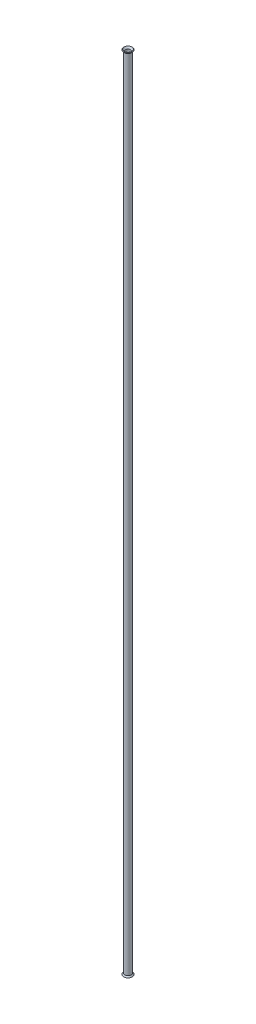
ISO-10303-21;
HEADER;
FILE_DESCRIPTION(('STEP AP214'),'2;1');
FILE_NAME('part.step','',(''),(''),'','','');
FILE_SCHEMA(('AUTOMOTIVE_DESIGN { 1 0 10303 214 1 1 1 1 }'));
ENDSEC;
DATA;
#1=APPLICATION_CONTEXT('core data for automotive mechanical design processes');
#2=APPLICATION_PROTOCOL_DEFINITION('international standard','automotive_design',2000,#1);
#3=PRODUCT_CONTEXT('',#1,'mechanical');
#4=PRODUCT('Part','Part','',(#3));
#5=PRODUCT_RELATED_PRODUCT_CATEGORY('part','',(#4));
#6=PRODUCT_DEFINITION_FORMATION('','',#4);
#7=PRODUCT_DEFINITION_CONTEXT('part definition',#1,'design');
#8=PRODUCT_DEFINITION('design','',#6,#7);
#9=PRODUCT_DEFINITION_SHAPE('','',#8);
#10=(LENGTH_UNIT() NAMED_UNIT(*) SI_UNIT(.MILLI.,.METRE.));
#11=(NAMED_UNIT(*) PLANE_ANGLE_UNIT() SI_UNIT($,.RADIAN.));
#12=(NAMED_UNIT(*) SI_UNIT($,.STERADIAN.) SOLID_ANGLE_UNIT());
#13=UNCERTAINTY_MEASURE_WITH_UNIT(LENGTH_MEASURE(1.E-05),#10,'distance_accuracy_value','');
#14=(GEOMETRIC_REPRESENTATION_CONTEXT(3) GLOBAL_UNCERTAINTY_ASSIGNED_CONTEXT((#13)) GLOBAL_UNIT_ASSIGNED_CONTEXT((#10,
#11,#12)) REPRESENTATION_CONTEXT('',''));
#15=CARTESIAN_POINT('',(0.,0.,0.));
#16=DIRECTION('',(0.,0.,1.));
#17=DIRECTION('',(1.,0.,0.));
#18=AXIS2_PLACEMENT_3D('',#15,#16,#17);
#19=CARTESIAN_POINT('',(0.,3093.72,0.));
#20=DIRECTION('',(0.,-1.,0.));
#21=DIRECTION('',(0.,0.,-1.));
#22=AXIS2_PLACEMENT_3D('',#19,#20,#21);
#23=CYLINDRICAL_SURFACE('',#22,12.7);
#24=CARTESIAN_POINT('',(0.,3093.72,0.));
#25=DIRECTION('',(0.,1.,0.));
#26=DIRECTION('',(0.,0.,1.));
#27=AXIS2_PLACEMENT_3D('',#24,#25,#26);
#28=CIRCLE('',#27,12.7);
#29=CARTESIAN_POINT('',(0.,3093.72,12.7));
#30=VERTEX_POINT('',#29);
#31=EDGE_CURVE('E10',#30,#30,#28,.T.);
#32=ORIENTED_EDGE('',*,*,#31,.F.);
#33=EDGE_LOOP('',(#32));
#34=FACE_BOUND('',#33,.T.);
#35=CARTESIAN_POINT('',(0.,0.,0.));
#36=DIRECTION('',(0.,1.,0.));
#37=DIRECTION('',(0.,0.,1.));
#38=AXIS2_PLACEMENT_3D('',#35,#36,#37);
#39=CIRCLE('',#38,12.7);
#40=CARTESIAN_POINT('',(0.,0.,12.7));
#41=VERTEX_POINT('',#40);
#42=EDGE_CURVE('E74',#41,#41,#39,.T.);
#43=ORIENTED_EDGE('',*,*,#42,.T.);
#44=EDGE_LOOP('',(#43));
#45=FACE_BOUND('',#44,.T.);
#46=ADVANCED_FACE('F39',(#34,#45),#23,.T.);
#47=CARTESIAN_POINT('',(0.,3093.72,0.));
#48=DIRECTION('',(0.,-1.,0.));
#49=DIRECTION('',(0.,0.,-1.));
#50=AXIS2_PLACEMENT_3D('',#47,#48,#49);
#51=CYLINDRICAL_SURFACE('',#50,9.525);
#52=CARTESIAN_POINT('',(0.,3093.72,0.));
#53=DIRECTION('',(0.,1.,0.));
#54=DIRECTION('',(0.,0.,1.));
#55=AXIS2_PLACEMENT_3D('',#52,#53,#54);
#56=CIRCLE('',#55,9.52500000000048);
#57=CARTESIAN_POINT('',(0.,3093.72,9.52500000000048));
#58=VERTEX_POINT('',#57);
#59=EDGE_CURVE('E51',#58,#58,#56,.T.);
#60=ORIENTED_EDGE('',*,*,#59,.T.);
#61=EDGE_LOOP('',(#60));
#62=FACE_BOUND('',#61,.T.);
#63=CARTESIAN_POINT('',(0.,0.,0.));
#64=DIRECTION('',(0.,1.,0.));
#65=DIRECTION('',(0.,0.,1.));
#66=AXIS2_PLACEMENT_3D('',#63,#64,#65);
#67=CIRCLE('',#66,9.525);
#68=CARTESIAN_POINT('',(0.,0.,9.525));
#69=VERTEX_POINT('',#68);
#70=EDGE_CURVE('E46',#69,#69,#67,.T.);
#71=ORIENTED_EDGE('',*,*,#70,.F.);
#72=EDGE_LOOP('',(#71));
#73=FACE_BOUND('',#72,.T.);
#74=ADVANCED_FACE('F92',(#62,#73),#51,.F.);
#75=CARTESIAN_POINT('',(0.,3100.14776452171,0.));
#76=DIRECTION('',(0.,1.,0.));
#77=DIRECTION('',(0.,0.,1.));
#78=AXIS2_PLACEMENT_3D('',#75,#76,#77);
#79=CONICAL_SURFACE('',#78,14.9185348394632,0.698131700797698);
#80=ORIENTED_EDGE('',*,*,#59,.F.);
#81=EDGE_LOOP('',(#80));
#82=FACE_BOUND('',#81,.T.);
#83=CARTESIAN_POINT('',(0.,3100.14776452171,0.));
#84=DIRECTION('',(0.,1.,0.));
#85=DIRECTION('',(0.,0.,1.));
#86=AXIS2_PLACEMENT_3D('',#83,#84,#85);
#87=CIRCLE('',#86,14.9185348394632);
#88=CARTESIAN_POINT('',(0.,3100.14776452171,14.9185348394632));
#89=VERTEX_POINT('',#88);
#90=EDGE_CURVE('E56',#89,#89,#87,.T.);
#91=ORIENTED_EDGE('',*,*,#90,.T.);
#92=EDGE_LOOP('',(#91));
#93=FACE_BOUND('',#92,.T.);
#94=ADVANCED_FACE('F97',(#82,#93),#79,.F.);
#95=CARTESIAN_POINT('',(0.,3098.58438221381,0.));
#96=DIRECTION('',(0.,-1.,0.));
#97=DIRECTION('',(0.,0.,-1.));
#98=AXIS2_PLACEMENT_3D('',#95,#96,#97);
#99=CONICAL_SURFACE('',#98,16.7817013215093,0.872664625997209);
#100=ORIENTED_EDGE('',*,*,#90,.F.);
#101=EDGE_LOOP('',(#100));
#102=FACE_BOUND('',#101,.T.);
#103=CARTESIAN_POINT('',(0.,3098.58438221381,0.));
#104=DIRECTION('',(0.,1.,0.));
#105=DIRECTION('',(0.,0.,1.));
#106=AXIS2_PLACEMENT_3D('',#103,#104,#105);
#107=CIRCLE('',#106,16.7817013215093);
#108=CARTESIAN_POINT('',(0.,3098.58438221381,16.7817013215093));
#109=VERTEX_POINT('',#108);
#110=EDGE_CURVE('E62',#109,#109,#107,.T.);
#111=ORIENTED_EDGE('',*,*,#110,.T.);
#112=EDGE_LOOP('',(#111));
#113=FACE_BOUND('',#112,.T.);
#114=ADVANCED_FACE('F102',(#102,#113),#99,.T.);
#115=CARTESIAN_POINT('',(0.,3093.72,0.));
#116=DIRECTION('',(0.,1.,0.));
#117=DIRECTION('',(0.,0.,1.));
#118=AXIS2_PLACEMENT_3D('',#115,#116,#117);
#119=CONICAL_SURFACE('',#118,12.7,0.698131700797708);
#120=ORIENTED_EDGE('',*,*,#110,.F.);
#121=EDGE_LOOP('',(#120));
#122=FACE_BOUND('',#121,.T.);
#123=ORIENTED_EDGE('',*,*,#31,.T.);
#124=EDGE_LOOP('',(#123));
#125=FACE_BOUND('',#124,.T.);
#126=ADVANCED_FACE('F109',(#122,#125),#119,.T.);
#127=CARTESIAN_POINT('',(0.,-6.42776452171212,0.));
#128=DIRECTION('',(0.,-1.,0.));
#129=DIRECTION('',(0.,0.,1.));
#130=AXIS2_PLACEMENT_3D('',#127,#128,#129);
#131=CONICAL_SURFACE('',#130,14.9185348394632,0.698131700797698);
#132=ORIENTED_EDGE('',*,*,#70,.T.);
#133=EDGE_LOOP('',(#132));
#134=FACE_BOUND('',#133,.T.);
#135=CARTESIAN_POINT('',(0.,-6.42776452171212,0.));
#136=DIRECTION('',(0.,1.,0.));
#137=DIRECTION('',(0.,0.,1.));
#138=AXIS2_PLACEMENT_3D('',#135,#136,#137);
#139=CIRCLE('',#138,14.9185348394632);
#140=CARTESIAN_POINT('',(0.,-6.42776452171212,14.9185348394632));
#141=VERTEX_POINT('',#140);
#142=EDGE_CURVE('E66',#141,#141,#139,.T.);
#143=ORIENTED_EDGE('',*,*,#142,.F.);
#144=EDGE_LOOP('',(#143));
#145=FACE_BOUND('',#144,.T.);
#146=ADVANCED_FACE('F88',(#134,#145),#131,.F.);
#147=CARTESIAN_POINT('',(0.,-4.86438221380547,0.));
#148=DIRECTION('',(0.,1.,0.));
#149=DIRECTION('',(0.,0.,-1.));
#150=AXIS2_PLACEMENT_3D('',#147,#148,#149);
#151=CONICAL_SURFACE('',#150,16.7817013215093,0.872664625997209);
#152=ORIENTED_EDGE('',*,*,#142,.T.);
#153=EDGE_LOOP('',(#152));
#154=FACE_BOUND('',#153,.T.);
#155=CARTESIAN_POINT('',(0.,-4.86438221380547,0.));
#156=DIRECTION('',(0.,1.,0.));
#157=DIRECTION('',(0.,0.,1.));
#158=AXIS2_PLACEMENT_3D('',#155,#156,#157);
#159=CIRCLE('',#158,16.7817013215093);
#160=CARTESIAN_POINT('',(0.,-4.86438221380547,16.7817013215093));
#161=VERTEX_POINT('',#160);
#162=EDGE_CURVE('E70',#161,#161,#159,.T.);
#163=ORIENTED_EDGE('',*,*,#162,.F.);
#164=EDGE_LOOP('',(#163));
#165=FACE_BOUND('',#164,.T.);
#166=ADVANCED_FACE('F82',(#154,#165),#151,.T.);
#167=CARTESIAN_POINT('',(0.,0.,0.));
#168=DIRECTION('',(0.,-1.,0.));
#169=DIRECTION('',(0.,0.,1.));
#170=AXIS2_PLACEMENT_3D('',#167,#168,#169);
#171=CONICAL_SURFACE('',#170,12.7,0.698131700797708);
#172=ORIENTED_EDGE('',*,*,#162,.T.);
#173=EDGE_LOOP('',(#172));
#174=FACE_BOUND('',#173,.T.);
#175=ORIENTED_EDGE('',*,*,#42,.F.);
#176=EDGE_LOOP('',(#175));
#177=FACE_BOUND('',#176,.T.);
#178=ADVANCED_FACE('F80',(#174,#177),#171,.T.);
#179=CLOSED_SHELL('',(#46,#74,#94,#114,#126,#146,#166,#178));
#180=MANIFOLD_SOLID_BREP('B2',#179);
#181=ADVANCED_BREP_SHAPE_REPRESENTATION('',(#18,#180),#14);
#182=SHAPE_DEFINITION_REPRESENTATION(#9,#181);
ENDSEC;
END-ISO-10303-21;
